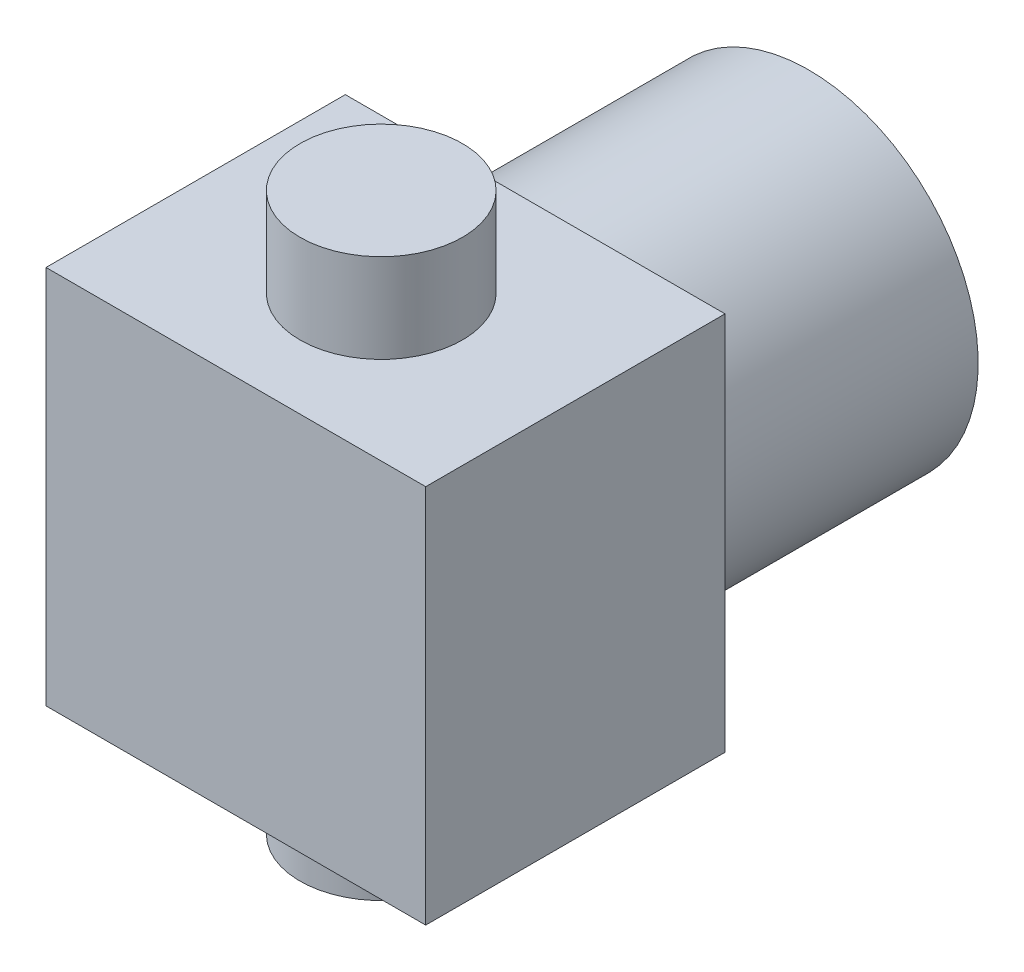
ISO-10303-21;
HEADER;
FILE_DESCRIPTION(('STEP AP214'),'2;1');
FILE_NAME('part.step','',(''),(''),'','','');
FILE_SCHEMA(('AUTOMOTIVE_DESIGN { 1 0 10303 214 1 1 1 1 }'));
ENDSEC;
DATA;
#1=APPLICATION_CONTEXT('core data for automotive mechanical design processes');
#2=APPLICATION_PROTOCOL_DEFINITION('international standard','automotive_design',2000,#1);
#3=PRODUCT_CONTEXT('',#1,'mechanical');
#4=PRODUCT('Part','Part','',(#3));
#5=PRODUCT_RELATED_PRODUCT_CATEGORY('part','',(#4));
#6=PRODUCT_DEFINITION_FORMATION('','',#4);
#7=PRODUCT_DEFINITION_CONTEXT('part definition',#1,'design');
#8=PRODUCT_DEFINITION('design','',#6,#7);
#9=PRODUCT_DEFINITION_SHAPE('','',#8);
#10=(LENGTH_UNIT() NAMED_UNIT(*) SI_UNIT(.MILLI.,.METRE.));
#11=(NAMED_UNIT(*) PLANE_ANGLE_UNIT() SI_UNIT($,.RADIAN.));
#12=(NAMED_UNIT(*) SI_UNIT($,.STERADIAN.) SOLID_ANGLE_UNIT());
#13=UNCERTAINTY_MEASURE_WITH_UNIT(LENGTH_MEASURE(1.E-05),#10,'distance_accuracy_value','');
#14=(GEOMETRIC_REPRESENTATION_CONTEXT(3) GLOBAL_UNCERTAINTY_ASSIGNED_CONTEXT((#13)) GLOBAL_UNIT_ASSIGNED_CONTEXT((#10,
#11,#12)) REPRESENTATION_CONTEXT('',''));
#15=CARTESIAN_POINT('',(0.,0.,0.));
#16=DIRECTION('',(0.,0.,1.));
#17=DIRECTION('',(1.,0.,0.));
#18=AXIS2_PLACEMENT_3D('',#15,#16,#17);
#19=CARTESIAN_POINT('',(0.,16.2999999999995,0.250000000000028));
#20=DIRECTION('',(0.,1.,0.));
#21=DIRECTION('',(0.,0.,1.));
#22=AXIS2_PLACEMENT_3D('',#19,#20,#21);
#23=PLANE('',#22);
#24=CARTESIAN_POINT('',(0.,16.2999999999995,0.250000000000028));
#25=DIRECTION('',(0.,1.,0.));
#26=DIRECTION('',(0.,0.,1.));
#27=AXIS2_PLACEMENT_3D('',#24,#25,#26);
#28=CIRCLE('',#27,4.75);
#29=CARTESIAN_POINT('',(0.,16.2999999999995,5.00000000000003));
#30=VERTEX_POINT('',#29);
#31=EDGE_CURVE('E95',#30,#30,#28,.F.);
#32=ORIENTED_EDGE('',*,*,#31,.F.);
#33=EDGE_LOOP('',(#32));
#34=FACE_BOUND('',#33,.T.);
#35=ADVANCED_FACE('F17',(#34),#23,.T.);
#36=CARTESIAN_POINT('',(0.,-16.2999999999999,0.249999999999972));
#37=DIRECTION('',(0.,-1.,0.));
#38=DIRECTION('',(0.,0.,-1.));
#39=AXIS2_PLACEMENT_3D('',#36,#37,#38);
#40=PLANE('',#39);
#41=CARTESIAN_POINT('',(0.,-16.2999999999999,0.249999999999972));
#42=DIRECTION('',(0.,-1.,0.));
#43=DIRECTION('',(1.,0.,0.));
#44=AXIS2_PLACEMENT_3D('',#41,#42,#43);
#45=CIRCLE('',#44,4.75);
#46=CARTESIAN_POINT('',(4.75,-16.2999999999999,0.249999999999972));
#47=VERTEX_POINT('',#46);
#48=EDGE_CURVE('E66',#47,#47,#45,.F.);
#49=ORIENTED_EDGE('',*,*,#48,.F.);
#50=EDGE_LOOP('',(#49));
#51=FACE_BOUND('',#50,.T.);
#52=ADVANCED_FACE('F176',(#51),#40,.T.);
#53=CARTESIAN_POINT('',(0.,11.0999999999994,0.250000000000028));
#54=DIRECTION('',(0.,1.,0.));
#55=DIRECTION('',(0.,0.,1.));
#56=AXIS2_PLACEMENT_3D('',#53,#54,#55);
#57=CYLINDRICAL_SURFACE('',#56,4.75);
#58=CARTESIAN_POINT('',(0.,11.0999999999994,0.250000000000028));
#59=DIRECTION('',(0.,1.,0.));
#60=DIRECTION('',(0.,0.,1.));
#61=AXIS2_PLACEMENT_3D('',#58,#59,#60);
#62=CIRCLE('',#61,4.75);
#63=CARTESIAN_POINT('',(0.,11.0999999999994,5.00000000000003));
#64=VERTEX_POINT('',#63);
#65=EDGE_CURVE('E75',#64,#64,#62,.F.);
#66=ORIENTED_EDGE('',*,*,#65,.F.);
#67=EDGE_LOOP('',(#66));
#68=FACE_BOUND('',#67,.T.);
#69=ORIENTED_EDGE('',*,*,#31,.T.);
#70=EDGE_LOOP('',(#69));
#71=FACE_BOUND('',#70,.T.);
#72=ADVANCED_FACE('F174',(#68,#71),#57,.T.);
#73=CARTESIAN_POINT('',(1.11022302462516E-13,-2.22044604925031E-13,8.74999999999998));
#74=DIRECTION('',(0.,0.,1.));
#75=DIRECTION('',(1.,0.,0.));
#76=AXIS2_PLACEMENT_3D('',#73,#74,#75);
#77=PLANE('',#76);
#78=DIRECTION('',(0.,1.,0.));
#79=VECTOR('',#78,1.);
#80=CARTESIAN_POINT('',(11.1000000000001,11.0999999999994,8.74999999999998));
#81=LINE('',#80,#79);
#82=CARTESIAN_POINT('',(11.1000000000001,11.0999999999994,8.74999999999998));
#83=VERTEX_POINT('',#82);
#84=CARTESIAN_POINT('',(11.1000000000001,-11.0999999999999,8.74999999999998));
#85=VERTEX_POINT('',#84);
#86=EDGE_CURVE('E59',#83,#85,#81,.F.);
#87=ORIENTED_EDGE('',*,*,#86,.F.);
#88=DIRECTION('',(1.,0.,0.));
#89=VECTOR('',#88,1.);
#90=CARTESIAN_POINT('',(-11.0999999999999,11.0999999999994,8.74999999999998));
#91=LINE('',#90,#89);
#92=CARTESIAN_POINT('',(-11.0999999999999,11.0999999999994,8.74999999999998));
#93=VERTEX_POINT('',#92);
#94=EDGE_CURVE('E56',#93,#83,#91,.T.);
#95=ORIENTED_EDGE('',*,*,#94,.F.);
#96=DIRECTION('',(0.,1.,0.));
#97=VECTOR('',#96,1.);
#98=CARTESIAN_POINT('',(-11.0999999999999,-11.0999999999999,8.74999999999998));
#99=LINE('',#98,#97);
#100=CARTESIAN_POINT('',(-11.0999999999999,-11.0999999999999,8.74999999999998));
#101=VERTEX_POINT('',#100);
#102=EDGE_CURVE('E92',#101,#93,#99,.T.);
#103=ORIENTED_EDGE('',*,*,#102,.F.);
#104=DIRECTION('',(1.,0.,0.));
#105=VECTOR('',#104,1.);
#106=CARTESIAN_POINT('',(11.1000000000001,-11.0999999999999,8.74999999999998));
#107=LINE('',#106,#105);
#108=EDGE_CURVE('E63',#85,#101,#107,.F.);
#109=ORIENTED_EDGE('',*,*,#108,.F.);
#110=EDGE_LOOP('',(#87,#95,#103,#109));
#111=FACE_BOUND('',#110,.T.);
#112=ADVANCED_FACE('F61',(#111),#77,.T.);
#113=CARTESIAN_POINT('',(0.,-11.0999999999999,0.249999999999972));
#114=DIRECTION('',(0.,-1.,0.));
#115=DIRECTION('',(1.,0.,0.));
#116=AXIS2_PLACEMENT_3D('',#113,#114,#115);
#117=CYLINDRICAL_SURFACE('',#116,4.75);
#118=CARTESIAN_POINT('',(0.,-11.0999999999999,0.249999999999972));
#119=DIRECTION('',(0.,-1.,0.));
#120=DIRECTION('',(1.,0.,0.));
#121=AXIS2_PLACEMENT_3D('',#118,#119,#120);
#122=CIRCLE('',#121,4.75);
#123=CARTESIAN_POINT('',(4.75,-11.0999999999999,0.249999999999972));
#124=VERTEX_POINT('',#123);
#125=EDGE_CURVE('E86',#124,#124,#122,.F.);
#126=ORIENTED_EDGE('',*,*,#125,.F.);
#127=EDGE_LOOP('',(#126));
#128=FACE_BOUND('',#127,.T.);
#129=ORIENTED_EDGE('',*,*,#48,.T.);
#130=EDGE_LOOP('',(#129));
#131=FACE_BOUND('',#130,.T.);
#132=ADVANCED_FACE('F168',(#128,#131),#117,.T.);
#133=CARTESIAN_POINT('',(11.1000000000001,11.0999999999994,-8.74999999999998));
#134=DIRECTION('',(1.,0.,0.));
#135=DIRECTION('',(0.,0.,-1.));
#136=AXIS2_PLACEMENT_3D('',#133,#134,#135);
#137=PLANE('',#136);
#138=DIRECTION('',(0.,1.,0.));
#139=VECTOR('',#138,1.);
#140=CARTESIAN_POINT('',(11.1000000000001,-2.22044604925031E-13,-8.74999999999998));
#141=LINE('',#140,#139);
#142=CARTESIAN_POINT('',(11.1000000000001,-11.0999999999999,-8.74999999999998));
#143=VERTEX_POINT('',#142);
#144=CARTESIAN_POINT('',(11.1000000000001,11.0999999999994,-8.74999999999998));
#145=VERTEX_POINT('',#144);
#146=EDGE_CURVE('E72',#143,#145,#141,.T.);
#147=ORIENTED_EDGE('',*,*,#146,.T.);
#148=DIRECTION('',(0.,0.,1.));
#149=VECTOR('',#148,1.);
#150=CARTESIAN_POINT('',(11.1000000000001,11.0999999999994,-8.74999999999998));
#151=LINE('',#150,#149);
#152=EDGE_CURVE('E69',#83,#145,#151,.F.);
#153=ORIENTED_EDGE('',*,*,#152,.F.);
#154=ORIENTED_EDGE('',*,*,#86,.T.);
#155=DIRECTION('',(0.,0.,-1.));
#156=VECTOR('',#155,1.);
#157=CARTESIAN_POINT('',(11.1000000000001,-11.0999999999999,-8.74999999999998));
#158=LINE('',#157,#156);
#159=EDGE_CURVE('E89',#143,#85,#158,.F.);
#160=ORIENTED_EDGE('',*,*,#159,.F.);
#161=EDGE_LOOP('',(#147,#153,#154,#160));
#162=FACE_BOUND('',#161,.T.);
#163=ADVANCED_FACE('F70',(#162),#137,.T.);
#164=CARTESIAN_POINT('',(-11.0999999999999,11.0999999999994,-8.74999999999998));
#165=DIRECTION('',(0.,1.,0.));
#166=DIRECTION('',(0.,0.,1.));
#167=AXIS2_PLACEMENT_3D('',#164,#165,#166);
#168=PLANE('',#167);
#169=ORIENTED_EDGE('',*,*,#65,.T.);
#170=EDGE_LOOP('',(#169));
#171=FACE_BOUND('',#170,.T.);
#172=DIRECTION('',(1.,0.,0.));
#173=VECTOR('',#172,1.);
#174=CARTESIAN_POINT('',(1.11022302462516E-13,11.0999999999994,-8.74999999999998));
#175=LINE('',#174,#173);
#176=CARTESIAN_POINT('',(-11.0999999999999,11.0999999999994,-8.74999999999998));
#177=VERTEX_POINT('',#176);
#178=EDGE_CURVE('E521',#145,#177,#175,.F.);
#179=ORIENTED_EDGE('',*,*,#178,.T.);
#180=DIRECTION('',(0.,0.,1.));
#181=VECTOR('',#180,1.);
#182=CARTESIAN_POINT('',(-11.0999999999999,11.0999999999994,-8.74999999999998));
#183=LINE('',#182,#181);
#184=EDGE_CURVE('E78',#93,#177,#183,.F.);
#185=ORIENTED_EDGE('',*,*,#184,.F.);
#186=ORIENTED_EDGE('',*,*,#94,.T.);
#187=ORIENTED_EDGE('',*,*,#152,.T.);
#188=EDGE_LOOP('',(#179,#185,#186,#187));
#189=FACE_BOUND('',#188,.T.);
#190=ADVANCED_FACE('F77',(#171,#189),#168,.T.);
#191=CARTESIAN_POINT('',(-11.0999999999999,-11.0999999999999,-8.74999999999998));
#192=DIRECTION('',(-1.,0.,0.));
#193=DIRECTION('',(0.,0.,1.));
#194=AXIS2_PLACEMENT_3D('',#191,#192,#193);
#195=PLANE('',#194);
#196=DIRECTION('',(0.,1.,0.));
#197=VECTOR('',#196,1.);
#198=CARTESIAN_POINT('',(-11.0999999999999,-2.22044604925031E-13,-8.74999999999998));
#199=LINE('',#198,#197);
#200=CARTESIAN_POINT('',(-11.0999999999999,-11.0999999999999,-8.74999999999998));
#201=VERTEX_POINT('',#200);
#202=EDGE_CURVE('E35',#177,#201,#199,.F.);
#203=ORIENTED_EDGE('',*,*,#202,.T.);
#204=DIRECTION('',(0.,0.,-1.));
#205=VECTOR('',#204,1.);
#206=CARTESIAN_POINT('',(-11.0999999999999,-11.0999999999999,-8.74999999999998));
#207=LINE('',#206,#205);
#208=EDGE_CURVE('E518',#101,#201,#207,.T.);
#209=ORIENTED_EDGE('',*,*,#208,.F.);
#210=ORIENTED_EDGE('',*,*,#102,.T.);
#211=ORIENTED_EDGE('',*,*,#184,.T.);
#212=EDGE_LOOP('',(#203,#209,#210,#211));
#213=FACE_BOUND('',#212,.T.);
#214=ADVANCED_FACE('F159',(#213),#195,.T.);
#215=CARTESIAN_POINT('',(11.1000000000001,-11.0999999999999,-8.74999999999998));
#216=DIRECTION('',(0.,-1.,0.));
#217=DIRECTION('',(0.,0.,-1.));
#218=AXIS2_PLACEMENT_3D('',#215,#216,#217);
#219=PLANE('',#218);
#220=ORIENTED_EDGE('',*,*,#125,.T.);
#221=EDGE_LOOP('',(#220));
#222=FACE_BOUND('',#221,.T.);
#223=DIRECTION('',(1.,0.,0.));
#224=VECTOR('',#223,1.);
#225=CARTESIAN_POINT('',(1.11022302462516E-13,-11.0999999999999,-8.74999999999998));
#226=LINE('',#225,#224);
#227=EDGE_CURVE('E85',#201,#143,#226,.T.);
#228=ORIENTED_EDGE('',*,*,#227,.T.);
#229=ORIENTED_EDGE('',*,*,#159,.T.);
#230=ORIENTED_EDGE('',*,*,#108,.T.);
#231=ORIENTED_EDGE('',*,*,#208,.T.);
#232=EDGE_LOOP('',(#228,#229,#230,#231));
#233=FACE_BOUND('',#232,.T.);
#234=ADVANCED_FACE('F155',(#222,#233),#219,.T.);
#235=CARTESIAN_POINT('',(1.11022302462516E-13,-2.22044604925031E-13,-8.74999999999998));
#236=DIRECTION('',(0.,0.,1.));
#237=DIRECTION('',(1.,0.,0.));
#238=AXIS2_PLACEMENT_3D('',#235,#236,#237);
#239=PLANE('',#238);
#240=CARTESIAN_POINT('',(1.11022302462516E-13,-2.22044604925031E-13,-8.74999999999998));
#241=DIRECTION('',(0.,0.,-1.));
#242=DIRECTION('',(-1.,0.,0.));
#243=AXIS2_PLACEMENT_3D('',#240,#241,#242);
#244=CIRCLE('',#243,9.9);
#245=CARTESIAN_POINT('',(-9.89999999999989,-2.22044604925031E-13,-8.74999999999998));
#246=VERTEX_POINT('',#245);
#247=EDGE_CURVE('E26',#246,#246,#244,.T.);
#248=ORIENTED_EDGE('',*,*,#247,.F.);
#249=EDGE_LOOP('',(#248));
#250=FACE_BOUND('',#249,.T.);
#251=ORIENTED_EDGE('',*,*,#202,.F.);
#252=ORIENTED_EDGE('',*,*,#178,.F.);
#253=ORIENTED_EDGE('',*,*,#146,.F.);
#254=ORIENTED_EDGE('',*,*,#227,.F.);
#255=EDGE_LOOP('',(#251,#252,#253,#254));
#256=FACE_BOUND('',#255,.T.);
#257=ADVANCED_FACE('F151',(#250,#256),#239,.F.);
#258=CARTESIAN_POINT('',(1.11022302462516E-13,-2.22044604925031E-13,-24.75));
#259=DIRECTION('',(0.,0.,-1.));
#260=DIRECTION('',(-1.,0.,0.));
#261=AXIS2_PLACEMENT_3D('',#258,#259,#260);
#262=PLANE('',#261);
#263=CARTESIAN_POINT('',(1.11022302462516E-13,-2.22044604925031E-13,-24.75));
#264=DIRECTION('',(0.,0.,-1.));
#265=DIRECTION('',(-1.,0.,0.));
#266=AXIS2_PLACEMENT_3D('',#263,#264,#265);
#267=CIRCLE('',#266,9.9);
#268=CARTESIAN_POINT('',(-9.89999999999989,-2.22044604925031E-13,-24.75));
#269=VERTEX_POINT('',#268);
#270=EDGE_CURVE('E11',#269,#269,#267,.F.);
#271=ORIENTED_EDGE('',*,*,#270,.F.);
#272=EDGE_LOOP('',(#271));
#273=FACE_BOUND('',#272,.T.);
#274=ADVANCED_FACE('F147',(#273),#262,.T.);
#275=CARTESIAN_POINT('',(1.11022302462516E-13,-2.22044604925031E-13,-8.74999999999998));
#276=DIRECTION('',(0.,0.,-1.));
#277=DIRECTION('',(-1.,0.,0.));
#278=AXIS2_PLACEMENT_3D('',#275,#276,#277);
#279=CYLINDRICAL_SURFACE('',#278,9.9);
#280=ORIENTED_EDGE('',*,*,#247,.T.);
#281=EDGE_LOOP('',(#280));
#282=FACE_BOUND('',#281,.T.);
#283=ORIENTED_EDGE('',*,*,#270,.T.);
#284=EDGE_LOOP('',(#283));
#285=FACE_BOUND('',#284,.T.);
#286=ADVANCED_FACE('F144',(#282,#285),#279,.T.);
#287=CLOSED_SHELL('',(#35,#52,#72,#112,#132,#163,#190,#214,#234,#257,#274,#286));
#288=CARTESIAN_POINT('',(0.,11.0999999999994,0.250000000000028));
#289=DIRECTION('',(0.,1.,0.));
#290=DIRECTION('',(0.,0.,1.));
#291=AXIS2_PLACEMENT_3D('',#288,#289,#290);
#292=PLANE('',#291);
#293=CARTESIAN_POINT('',(0.,11.0999999999994,0.250000000000028));
#294=DIRECTION('',(0.,-1.,0.));
#295=DIRECTION('',(0.,0.,-1.));
#296=AXIS2_PLACEMENT_3D('',#293,#294,#295);
#297=CIRCLE('',#296,3.2);
#298=CARTESIAN_POINT('',(0.,11.0999999999994,-2.94999999999997));
#299=VERTEX_POINT('',#298);
#300=EDGE_CURVE('E101',#299,#299,#297,.T.);
#301=ORIENTED_EDGE('',*,*,#300,.T.);
#302=EDGE_LOOP('',(#301));
#303=FACE_BOUND('',#302,.T.);
#304=ADVANCED_FACE('F137',(#303),#292,.F.);
#305=CARTESIAN_POINT('',(0.,11.0999999999994,0.250000000000028));
#306=DIRECTION('',(0.,-1.,0.));
#307=DIRECTION('',(0.,0.,-1.));
#308=AXIS2_PLACEMENT_3D('',#305,#306,#307);
#309=CYLINDRICAL_SURFACE('',#308,3.2);
#310=CARTESIAN_POINT('',(0.,9.09999999999944,0.250000000000028));
#311=DIRECTION('',(0.,-1.,0.));
#312=DIRECTION('',(0.,0.,-1.));
#313=AXIS2_PLACEMENT_3D('',#310,#311,#312);
#314=CIRCLE('',#313,3.2);
#315=CARTESIAN_POINT('',(0.,9.09999999999944,-2.94999999999997));
#316=VERTEX_POINT('',#315);
#317=EDGE_CURVE('E98',#316,#316,#314,.F.);
#318=ORIENTED_EDGE('',*,*,#317,.F.);
#319=EDGE_LOOP('',(#318));
#320=FACE_BOUND('',#319,.T.);
#321=ORIENTED_EDGE('',*,*,#300,.F.);
#322=EDGE_LOOP('',(#321));
#323=FACE_BOUND('',#322,.T.);
#324=ADVANCED_FACE('F131',(#320,#323),#309,.F.);
#325=CARTESIAN_POINT('',(0.,9.09999999999944,0.250000000000028));
#326=DIRECTION('',(0.,1.,0.));
#327=DIRECTION('',(0.,0.,1.));
#328=AXIS2_PLACEMENT_3D('',#325,#326,#327);
#329=PLANE('',#328);
#330=ORIENTED_EDGE('',*,*,#317,.T.);
#331=EDGE_LOOP('',(#330));
#332=FACE_BOUND('',#331,.T.);
#333=ADVANCED_FACE('F129',(#332),#329,.T.);
#334=CLOSED_SHELL('',(#304,#324,#333));
#335=CARTESIAN_POINT('',(0.,-9.09999999999989,0.249999999999972));
#336=DIRECTION('',(0.,-1.,0.));
#337=DIRECTION('',(0.,0.,-1.));
#338=AXIS2_PLACEMENT_3D('',#335,#336,#337);
#339=PLANE('',#338);
#340=CARTESIAN_POINT('',(0.,-9.09999999999989,0.249999999999972));
#341=DIRECTION('',(0.,1.,0.));
#342=DIRECTION('',(-1.,0.,0.));
#343=AXIS2_PLACEMENT_3D('',#340,#341,#342);
#344=CIRCLE('',#343,3.2);
#345=CARTESIAN_POINT('',(-3.2,-9.09999999999989,0.249999999999972));
#346=VERTEX_POINT('',#345);
#347=EDGE_CURVE('E20',#346,#346,#344,.F.);
#348=ORIENTED_EDGE('',*,*,#347,.T.);
#349=EDGE_LOOP('',(#348));
#350=FACE_BOUND('',#349,.T.);
#351=ADVANCED_FACE('F110',(#350),#339,.T.);
#352=CARTESIAN_POINT('',(0.,-11.0999999999999,0.249999999999972));
#353=DIRECTION('',(0.,1.,0.));
#354=DIRECTION('',(-1.,0.,0.));
#355=AXIS2_PLACEMENT_3D('',#352,#353,#354);
#356=CYLINDRICAL_SURFACE('',#355,3.2);
#357=ORIENTED_EDGE('',*,*,#347,.F.);
#358=EDGE_LOOP('',(#357));
#359=FACE_BOUND('',#358,.T.);
#360=CARTESIAN_POINT('',(0.,-11.0999999999999,0.249999999999972));
#361=DIRECTION('',(0.,1.,0.));
#362=DIRECTION('',(-1.,0.,0.));
#363=AXIS2_PLACEMENT_3D('',#360,#361,#362);
#364=CIRCLE('',#363,3.2);
#365=CARTESIAN_POINT('',(-3.2,-11.0999999999999,0.249999999999972));
#366=VERTEX_POINT('',#365);
#367=EDGE_CURVE('E103',#366,#366,#364,.F.);
#368=ORIENTED_EDGE('',*,*,#367,.T.);
#369=EDGE_LOOP('',(#368));
#370=FACE_BOUND('',#369,.T.);
#371=ADVANCED_FACE('F112',(#359,#370),#356,.F.);
#372=CARTESIAN_POINT('',(0.,-11.0999999999999,0.249999999999972));
#373=DIRECTION('',(0.,-1.,0.));
#374=DIRECTION('',(0.,0.,-1.));
#375=AXIS2_PLACEMENT_3D('',#372,#373,#374);
#376=PLANE('',#375);
#377=ORIENTED_EDGE('',*,*,#367,.F.);
#378=EDGE_LOOP('',(#377));
#379=FACE_BOUND('',#378,.T.);
#380=ADVANCED_FACE('F114',(#379),#376,.F.);
#381=CLOSED_SHELL('',(#351,#371,#380));
#382=ORIENTED_CLOSED_SHELL('',*,#334,.T.);
#383=ORIENTED_CLOSED_SHELL('',*,#381,.T.);
#384=BREP_WITH_VOIDS('B1',#287,(#382,#383));
#385=ADVANCED_BREP_SHAPE_REPRESENTATION('',(#18,#384),#14);
#386=SHAPE_DEFINITION_REPRESENTATION(#9,#385);
ENDSEC;
END-ISO-10303-21;
